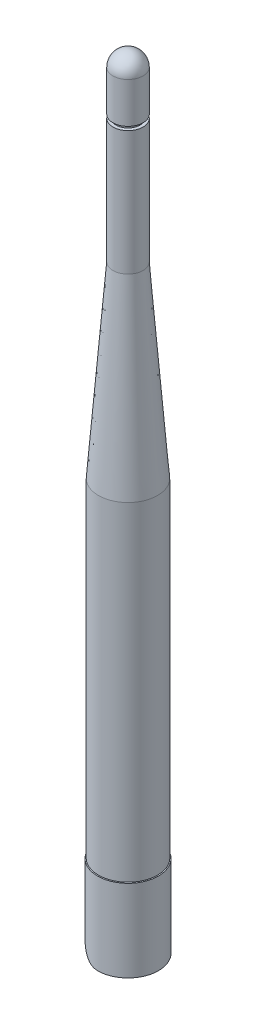
ISO-10303-21;
HEADER;
FILE_DESCRIPTION(('STEP AP214'),'2;1');
FILE_NAME('part.step','',(''),(''),'','','');
FILE_SCHEMA(('AUTOMOTIVE_DESIGN { 1 0 10303 214 1 1 1 1 }'));
ENDSEC;
DATA;
#1=APPLICATION_CONTEXT('core data for automotive mechanical design processes');
#2=APPLICATION_PROTOCOL_DEFINITION('international standard','automotive_design',2000,#1);
#3=PRODUCT_CONTEXT('',#1,'mechanical');
#4=PRODUCT('Part','Part','',(#3));
#5=PRODUCT_RELATED_PRODUCT_CATEGORY('part','',(#4));
#6=PRODUCT_DEFINITION_FORMATION('','',#4);
#7=PRODUCT_DEFINITION_CONTEXT('part definition',#1,'design');
#8=PRODUCT_DEFINITION('design','',#6,#7);
#9=PRODUCT_DEFINITION_SHAPE('','',#8);
#10=(LENGTH_UNIT() NAMED_UNIT(*) SI_UNIT(.MILLI.,.METRE.));
#11=(NAMED_UNIT(*) PLANE_ANGLE_UNIT() SI_UNIT($,.RADIAN.));
#12=(NAMED_UNIT(*) SI_UNIT($,.STERADIAN.) SOLID_ANGLE_UNIT());
#13=UNCERTAINTY_MEASURE_WITH_UNIT(LENGTH_MEASURE(1.E-05),#10,'distance_accuracy_value','');
#14=(GEOMETRIC_REPRESENTATION_CONTEXT(3) GLOBAL_UNCERTAINTY_ASSIGNED_CONTEXT((#13)) GLOBAL_UNIT_ASSIGNED_CONTEXT((#10,
#11,#12)) REPRESENTATION_CONTEXT('',''));
#15=CARTESIAN_POINT('',(0.,0.,0.));
#16=DIRECTION('',(0.,0.,1.));
#17=DIRECTION('',(1.,0.,0.));
#18=AXIS2_PLACEMENT_3D('',#15,#16,#17);
#19=CARTESIAN_POINT('',(6.73734999999998,169.81455,0.));
#20=DIRECTION('',(0.,-1.,0.));
#21=DIRECTION('',(1.,0.,0.));
#22=AXIS2_PLACEMENT_3D('',#19,#20,#21);
#23=SPHERICAL_SURFACE('',#22,3.33375000000006);
#24=CARTESIAN_POINT('',(6.73734999999998,169.81455,0.));
#25=DIRECTION('',(0.,-1.,0.));
#26=DIRECTION('',(1.,0.,0.));
#27=AXIS2_PLACEMENT_3D('',#24,#25,#26);
#28=CIRCLE('',#27,3.33375000000002);
#29=CARTESIAN_POINT('',(10.0711,169.81455,0.));
#30=VERTEX_POINT('',#29);
#31=EDGE_CURVE('E11',#30,#30,#28,.T.);
#32=ORIENTED_EDGE('',*,*,#31,.F.);
#33=EDGE_LOOP('',(#32));
#34=FACE_BOUND('',#33,.T.);
#35=ADVANCED_FACE('F49',(#34),#23,.T.);
#36=CARTESIAN_POINT('',(6.73735,18.1483,0.));
#37=DIRECTION('',(0.,-1.,0.));
#38=DIRECTION('',(1.,0.,0.));
#39=AXIS2_PLACEMENT_3D('',#36,#37,#38);
#40=CYLINDRICAL_SURFACE('',#39,3.33375000000002);
#41=ORIENTED_EDGE('',*,*,#31,.T.);
#42=EDGE_LOOP('',(#41));
#43=FACE_BOUND('',#42,.T.);
#44=CARTESIAN_POINT('',(6.73734999999998,160.8293,0.));
#45=DIRECTION('',(0.,-1.,0.));
#46=DIRECTION('',(1.,0.,0.));
#47=AXIS2_PLACEMENT_3D('',#44,#45,#46);
#48=CIRCLE('',#47,3.33375000000002);
#49=CARTESIAN_POINT('',(10.0711,160.8293,0.));
#50=VERTEX_POINT('',#49);
#51=EDGE_CURVE('E56',#50,#50,#48,.T.);
#52=ORIENTED_EDGE('',*,*,#51,.F.);
#53=EDGE_LOOP('',(#52));
#54=FACE_BOUND('',#53,.T.);
#55=ADVANCED_FACE('F113',(#43,#54),#40,.T.);
#56=CARTESIAN_POINT('',(10.0711,160.8293,0.));
#57=DIRECTION('',(0.,-1.,0.));
#58=DIRECTION('',(1.,0.,0.));
#59=AXIS2_PLACEMENT_3D('',#56,#57,#58);
#60=PLANE('',#59);
#61=ORIENTED_EDGE('',*,*,#51,.T.);
#62=EDGE_LOOP('',(#61));
#63=FACE_BOUND('',#62,.T.);
#64=CARTESIAN_POINT('',(6.73734999999998,160.8293,0.));
#65=DIRECTION('',(0.,-1.,0.));
#66=DIRECTION('',(1.,0.,0.));
#67=AXIS2_PLACEMENT_3D('',#64,#65,#66);
#68=CIRCLE('',#67,2.62890000000002);
#69=CARTESIAN_POINT('',(9.36625,160.8293,0.));
#70=VERTEX_POINT('',#69);
#71=EDGE_CURVE('E61',#70,#70,#68,.T.);
#72=ORIENTED_EDGE('',*,*,#71,.F.);
#73=EDGE_LOOP('',(#72));
#74=FACE_BOUND('',#73,.T.);
#75=ADVANCED_FACE('F118',(#63,#74),#60,.T.);
#76=CARTESIAN_POINT('',(6.73735,18.1483,0.));
#77=DIRECTION('',(0.,-1.,0.));
#78=DIRECTION('',(1.,0.,0.));
#79=AXIS2_PLACEMENT_3D('',#76,#77,#78);
#80=CYLINDRICAL_SURFACE('',#79,2.62890000000002);
#81=ORIENTED_EDGE('',*,*,#71,.T.);
#82=EDGE_LOOP('',(#81));
#83=FACE_BOUND('',#82,.T.);
#84=CARTESIAN_POINT('',(6.73734999999998,160.0165,0.));
#85=DIRECTION('',(0.,-1.,0.));
#86=DIRECTION('',(1.,0.,0.));
#87=AXIS2_PLACEMENT_3D('',#84,#85,#86);
#88=CIRCLE('',#87,2.62890000000002);
#89=CARTESIAN_POINT('',(9.36625,160.0165,0.));
#90=VERTEX_POINT('',#89);
#91=EDGE_CURVE('E66',#90,#90,#88,.T.);
#92=ORIENTED_EDGE('',*,*,#91,.F.);
#93=EDGE_LOOP('',(#92));
#94=FACE_BOUND('',#93,.T.);
#95=ADVANCED_FACE('F122',(#83,#94),#80,.T.);
#96=CARTESIAN_POINT('',(9.36625,160.0165,0.));
#97=DIRECTION('',(0.,1.,0.));
#98=DIRECTION('',(-1.,0.,0.));
#99=AXIS2_PLACEMENT_3D('',#96,#97,#98);
#100=PLANE('',#99);
#101=ORIENTED_EDGE('',*,*,#91,.T.);
#102=EDGE_LOOP('',(#101));
#103=FACE_BOUND('',#102,.T.);
#104=CARTESIAN_POINT('',(6.73734999999998,160.0165,0.));
#105=DIRECTION('',(0.,-1.,0.));
#106=DIRECTION('',(1.,0.,0.));
#107=AXIS2_PLACEMENT_3D('',#104,#105,#106);
#108=CIRCLE('',#107,3.33375000000002);
#109=CARTESIAN_POINT('',(10.0711,160.0165,0.));
#110=VERTEX_POINT('',#109);
#111=EDGE_CURVE('E72',#110,#110,#108,.T.);
#112=ORIENTED_EDGE('',*,*,#111,.F.);
#113=EDGE_LOOP('',(#112));
#114=FACE_BOUND('',#113,.T.);
#115=ADVANCED_FACE('F128',(#103,#114),#100,.T.);
#116=CARTESIAN_POINT('',(6.73735,18.1483,0.));
#117=DIRECTION('',(0.,-1.,0.));
#118=DIRECTION('',(1.,0.,0.));
#119=AXIS2_PLACEMENT_3D('',#116,#117,#118);
#120=CYLINDRICAL_SURFACE('',#119,3.33375000000002);
#121=ORIENTED_EDGE('',*,*,#111,.T.);
#122=EDGE_LOOP('',(#121));
#123=FACE_BOUND('',#122,.T.);
#124=CARTESIAN_POINT('',(6.73734999999999,132.5083,0.));
#125=DIRECTION('',(0.,-1.,0.));
#126=DIRECTION('',(1.,0.,0.));
#127=AXIS2_PLACEMENT_3D('',#124,#125,#126);
#128=CIRCLE('',#127,3.33375000000002);
#129=CARTESIAN_POINT('',(10.0711,132.5083,0.));
#130=VERTEX_POINT('',#129);
#131=EDGE_CURVE('E76',#130,#130,#128,.T.);
#132=ORIENTED_EDGE('',*,*,#131,.F.);
#133=EDGE_LOOP('',(#132));
#134=FACE_BOUND('',#133,.T.);
#135=ADVANCED_FACE('F132',(#123,#134),#120,.T.);
#136=CARTESIAN_POINT('',(6.73734999999999,90.9955,0.));
#137=DIRECTION('',(0.,-1.,0.));
#138=DIRECTION('',(1.,0.,0.));
#139=AXIS2_PLACEMENT_3D('',#136,#137,#138);
#140=CONICAL_SURFACE('',#139,6.54050000000001,0.0770941580717803);
#141=ORIENTED_EDGE('',*,*,#131,.T.);
#142=EDGE_LOOP('',(#141));
#143=FACE_BOUND('',#142,.T.);
#144=CARTESIAN_POINT('',(6.73734999999999,90.9955,0.));
#145=DIRECTION('',(0.,-1.,0.));
#146=DIRECTION('',(1.,0.,0.));
#147=AXIS2_PLACEMENT_3D('',#144,#145,#146);
#148=CIRCLE('',#147,6.54050000000001);
#149=CARTESIAN_POINT('',(13.27785,90.9955,0.));
#150=VERTEX_POINT('',#149);
#151=EDGE_CURVE('E80',#150,#150,#148,.T.);
#152=ORIENTED_EDGE('',*,*,#151,.F.);
#153=EDGE_LOOP('',(#152));
#154=FACE_BOUND('',#153,.T.);
#155=ADVANCED_FACE('F136',(#143,#154),#140,.T.);
#156=CARTESIAN_POINT('',(6.73735,18.1483,0.));
#157=DIRECTION('',(0.,-1.,0.));
#158=DIRECTION('',(1.,0.,0.));
#159=AXIS2_PLACEMENT_3D('',#156,#157,#158);
#160=CYLINDRICAL_SURFACE('',#159,6.54050000000001);
#161=ORIENTED_EDGE('',*,*,#151,.T.);
#162=EDGE_LOOP('',(#161));
#163=FACE_BOUND('',#162,.T.);
#164=CARTESIAN_POINT('',(6.73735,18.2245,0.));
#165=DIRECTION('',(0.,-1.,0.));
#166=DIRECTION('',(1.,0.,0.));
#167=AXIS2_PLACEMENT_3D('',#164,#165,#166);
#168=CIRCLE('',#167,6.5405);
#169=CARTESIAN_POINT('',(13.27785,18.2245,0.));
#170=VERTEX_POINT('',#169);
#171=EDGE_CURVE('E84',#170,#170,#168,.T.);
#172=ORIENTED_EDGE('',*,*,#171,.F.);
#173=EDGE_LOOP('',(#172));
#174=FACE_BOUND('',#173,.T.);
#175=ADVANCED_FACE('F109',(#163,#174),#160,.T.);
#176=CARTESIAN_POINT('',(13.27785,18.2245,0.));
#177=DIRECTION('',(0.,-1.,0.));
#178=DIRECTION('',(1.,0.,0.));
#179=AXIS2_PLACEMENT_3D('',#176,#177,#178);
#180=PLANE('',#179);
#181=ORIENTED_EDGE('',*,*,#171,.T.);
#182=EDGE_LOOP('',(#181));
#183=FACE_BOUND('',#182,.T.);
#184=CARTESIAN_POINT('',(6.73735,18.2245,0.));
#185=DIRECTION('',(0.,-1.,0.));
#186=DIRECTION('',(1.,0.,0.));
#187=AXIS2_PLACEMENT_3D('',#184,#185,#186);
#188=CIRCLE('',#187,1.42875);
#189=CARTESIAN_POINT('',(8.1661,18.2245,0.));
#190=VERTEX_POINT('',#189);
#191=EDGE_CURVE('E88',#190,#190,#188,.T.);
#192=ORIENTED_EDGE('',*,*,#191,.F.);
#193=EDGE_LOOP('',(#192));
#194=FACE_BOUND('',#193,.T.);
#195=ADVANCED_FACE('F101',(#183,#194),#180,.T.);
#196=CARTESIAN_POINT('',(6.73735,18.1483,0.));
#197=DIRECTION('',(0.,-1.,0.));
#198=DIRECTION('',(1.,0.,0.));
#199=AXIS2_PLACEMENT_3D('',#196,#197,#198);
#200=CYLINDRICAL_SURFACE('',#199,1.42875000000001);
#201=ORIENTED_EDGE('',*,*,#191,.T.);
#202=EDGE_LOOP('',(#201));
#203=FACE_BOUND('',#202,.T.);
#204=CARTESIAN_POINT('',(6.73734999999998,169.81455,0.));
#205=DIRECTION('',(0.,-1.,0.));
#206=DIRECTION('',(1.,0.,0.));
#207=AXIS2_PLACEMENT_3D('',#204,#205,#206);
#208=CIRCLE('',#207,1.42875000000002);
#209=CARTESIAN_POINT('',(8.1661,169.81455,0.));
#210=VERTEX_POINT('',#209);
#211=EDGE_CURVE('E92',#210,#210,#208,.T.);
#212=ORIENTED_EDGE('',*,*,#211,.F.);
#213=EDGE_LOOP('',(#212));
#214=FACE_BOUND('',#213,.T.);
#215=ADVANCED_FACE('F99',(#203,#214),#200,.F.);
#216=CARTESIAN_POINT('',(6.73734999999998,169.81455,0.));
#217=DIRECTION('',(0.,-1.,0.));
#218=DIRECTION('',(1.,0.,0.));
#219=AXIS2_PLACEMENT_3D('',#216,#217,#218);
#220=PLANE('',#219);
#221=ORIENTED_EDGE('',*,*,#211,.T.);
#222=EDGE_LOOP('',(#221));
#223=FACE_BOUND('',#222,.T.);
#224=ADVANCED_FACE('F97',(#223),#220,.T.);
#225=CLOSED_SHELL('',(#35,#55,#75,#95,#115,#135,#155,#175,#195,#215,#224));
#226=MANIFOLD_SOLID_BREP('B2',#225);
#227=CARTESIAN_POINT('',(10.9347,13.7033,-4.43865));
#228=DIRECTION('',(0.,0.,1.));
#229=DIRECTION('',(0.,-1.,0.));
#230=AXIS2_PLACEMENT_3D('',#227,#228,#229);
#231=PLANE('',#230);
#232=CARTESIAN_POINT('',(6.73735,7.747,-4.43865));
#233=DIRECTION('',(0.,0.,1.));
#234=DIRECTION('',(0.,-1.,0.));
#235=AXIS2_PLACEMENT_3D('',#232,#233,#234);
#236=CIRCLE('',#235,1.);
#237=CARTESIAN_POINT('',(7.73735,7.747,-4.43865));
#238=VERTEX_POINT('',#237);
#239=EDGE_CURVE('E325',#238,#238,#236,.T.);
#240=ORIENTED_EDGE('',*,*,#239,.F.);
#241=EDGE_LOOP('',(#240));
#242=FACE_BOUND('',#241,.T.);
#243=DIRECTION('',(0.,-1.,0.));
#244=VECTOR('',#243,1.);
#245=CARTESIAN_POINT('',(1.6688054,13.7033,-4.43865));
#246=LINE('',#245,#244);
#247=CARTESIAN_POINT('',(1.6688054,5.0685446,-4.43865714392927));
#248=VERTEX_POINT('',#247);
#249=CARTESIAN_POINT('',(1.6688054,0.,-4.43865714392927));
#250=VERTEX_POINT('',#249);
#251=EDGE_CURVE('E365',#248,#250,#246,.T.);
#252=ORIENTED_EDGE('',*,*,#251,.F.);
#253=CARTESIAN_POINT('',(6.73735,5.0685446,-4.43865));
#254=DIRECTION('',(0.,0.,1.));
#255=DIRECTION('',(0.,-1.,0.));
#256=AXIS2_PLACEMENT_3D('',#253,#254,#255);
#257=CIRCLE('',#256,5.0685446);
#258=CARTESIAN_POINT('',(6.73735,0.,-4.43865));
#259=VERTEX_POINT('',#258);
#260=EDGE_CURVE('E335',#259,#248,#257,.F.);
#261=ORIENTED_EDGE('',*,*,#260,.F.);
#262=DIRECTION('',(-1.,0.,0.));
#263=VECTOR('',#262,1.);
#264=CARTESIAN_POINT('',(10.9347,0.,-4.43865));
#265=LINE('',#264,#263);
#266=CARTESIAN_POINT('',(10.9347,0.,-4.43865));
#267=VERTEX_POINT('',#266);
#268=EDGE_CURVE('E638',#267,#259,#265,.T.);
#269=ORIENTED_EDGE('',*,*,#268,.F.);
#270=DIRECTION('',(0.,1.,0.));
#271=VECTOR('',#270,1.);
#272=CARTESIAN_POINT('',(10.9347,13.7033,-4.43865));
#273=LINE('',#272,#271);
#274=CARTESIAN_POINT('',(10.9347,13.7033,-4.43865));
#275=VERTEX_POINT('',#274);
#276=EDGE_CURVE('E627',#267,#275,#273,.T.);
#277=ORIENTED_EDGE('',*,*,#276,.T.);
#278=DIRECTION('',(-1.,0.,0.));
#279=VECTOR('',#278,1.);
#280=CARTESIAN_POINT('',(10.9347,13.7033,-4.43865));
#281=LINE('',#280,#279);
#282=CARTESIAN_POINT('',(1.6891,13.7033,-4.43865));
#283=VERTEX_POINT('',#282);
#284=EDGE_CURVE('E645',#275,#283,#281,.T.);
#285=ORIENTED_EDGE('',*,*,#284,.T.);
#286=DIRECTION('',(1.,0.,0.));
#287=VECTOR('',#286,1.);
#288=CARTESIAN_POINT('',(10.9347,13.7033,-4.43865));
#289=LINE('',#288,#287);
#290=CARTESIAN_POINT('',(1.66879288776381,13.7033,-4.43865));
#291=VERTEX_POINT('',#290);
#292=EDGE_CURVE('E600',#291,#283,#289,.T.);
#293=ORIENTED_EDGE('',*,*,#292,.F.);
#294=DIRECTION('',(0.,-1.,0.));
#295=VECTOR('',#294,1.);
#296=CARTESIAN_POINT('',(1.66879288776381,18.1483,-4.43864999999999));
#297=LINE('',#296,#295);
#298=EDGE_CURVE('E340',#291,#250,#297,.T.);
#299=ORIENTED_EDGE('',*,*,#298,.T.);
#300=EDGE_LOOP('',(#252,#261,#269,#277,#285,#293,#299));
#301=FACE_BOUND('',#300,.T.);
#302=ADVANCED_FACE('F220',(#242,#301),#231,.T.);
#303=CARTESIAN_POINT('',(10.9347,13.7033,4.43865));
#304=DIRECTION('',(0.,0.,-1.));
#305=DIRECTION('',(0.,1.,0.));
#306=AXIS2_PLACEMENT_3D('',#303,#304,#305);
#307=PLANE('',#306);
#308=CARTESIAN_POINT('',(6.73735,7.747,4.43865));
#309=DIRECTION('',(0.,0.,-1.));
#310=DIRECTION('',(0.,1.,0.));
#311=AXIS2_PLACEMENT_3D('',#308,#309,#310);
#312=CIRCLE('',#311,1.);
#313=CARTESIAN_POINT('',(7.73735,7.747,4.43865));
#314=VERTEX_POINT('',#313);
#315=EDGE_CURVE('E583',#314,#314,#312,.T.);
#316=ORIENTED_EDGE('',*,*,#315,.F.);
#317=EDGE_LOOP('',(#316));
#318=FACE_BOUND('',#317,.T.);
#319=DIRECTION('',(0.,1.,0.));
#320=VECTOR('',#319,1.);
#321=CARTESIAN_POINT('',(1.6688054,13.7033,4.43865));
#322=LINE('',#321,#320);
#323=CARTESIAN_POINT('',(1.6688054,0.,4.43865714392928));
#324=VERTEX_POINT('',#323);
#325=CARTESIAN_POINT('',(1.6688054,5.0685446,4.43865357196464));
#326=VERTEX_POINT('',#325);
#327=EDGE_CURVE('E47',#324,#326,#322,.T.);
#328=ORIENTED_EDGE('',*,*,#327,.F.);
#329=DIRECTION('',(0.,-1.,0.));
#330=VECTOR('',#329,1.);
#331=CARTESIAN_POINT('',(1.66879288776382,18.1483,4.43865000000001));
#332=LINE('',#331,#330);
#333=CARTESIAN_POINT('',(1.66879288776381,13.7033,4.43865));
#334=VERTEX_POINT('',#333);
#335=EDGE_CURVE('E346',#324,#334,#332,.F.);
#336=ORIENTED_EDGE('',*,*,#335,.T.);
#337=DIRECTION('',(-1.,0.,0.));
#338=VECTOR('',#337,1.);
#339=CARTESIAN_POINT('',(10.9347,13.7033,4.43865));
#340=LINE('',#339,#338);
#341=CARTESIAN_POINT('',(1.6891,13.7033,4.43865));
#342=VERTEX_POINT('',#341);
#343=EDGE_CURVE('E642',#342,#334,#340,.T.);
#344=ORIENTED_EDGE('',*,*,#343,.F.);
#345=CARTESIAN_POINT('',(10.9347,13.7033,4.43865));
#346=VERTEX_POINT('',#345);
#347=EDGE_CURVE('E643',#346,#342,#340,.T.);
#348=ORIENTED_EDGE('',*,*,#347,.F.);
#349=DIRECTION('',(0.,-1.,0.));
#350=VECTOR('',#349,1.);
#351=CARTESIAN_POINT('',(10.9347,13.7033,4.43865));
#352=LINE('',#351,#350);
#353=CARTESIAN_POINT('',(10.9347,0.,4.43865));
#354=VERTEX_POINT('',#353);
#355=EDGE_CURVE('E634',#346,#354,#352,.T.);
#356=ORIENTED_EDGE('',*,*,#355,.T.);
#357=DIRECTION('',(-1.,0.,0.));
#358=VECTOR('',#357,1.);
#359=CARTESIAN_POINT('',(10.9347,0.,4.43865));
#360=LINE('',#359,#358);
#361=CARTESIAN_POINT('',(6.73735,0.,4.43865));
#362=VERTEX_POINT('',#361);
#363=EDGE_CURVE('E640',#354,#362,#360,.T.);
#364=ORIENTED_EDGE('',*,*,#363,.T.);
#365=CARTESIAN_POINT('',(6.73735,5.0685446,4.43865));
#366=DIRECTION('',(0.,0.,-1.));
#367=DIRECTION('',(0.,1.,0.));
#368=AXIS2_PLACEMENT_3D('',#365,#366,#367);
#369=CIRCLE('',#368,5.0685446);
#370=EDGE_CURVE('E225',#326,#362,#369,.F.);
#371=ORIENTED_EDGE('',*,*,#370,.F.);
#372=EDGE_LOOP('',(#328,#336,#344,#348,#356,#364,#371));
#373=FACE_BOUND('',#372,.T.);
#374=ADVANCED_FACE('F419',(#318,#373),#307,.T.);
#375=CARTESIAN_POINT('',(6.73735,18.1483,0.));
#376=DIRECTION('',(0.,-1.,0.));
#377=DIRECTION('',(0.,0.,-1.));
#378=AXIS2_PLACEMENT_3D('',#375,#376,#377);
#379=CYLINDRICAL_SURFACE('',#378,6.73735);
#380=CARTESIAN_POINT('',(6.73735,18.1483,0.));
#381=DIRECTION('',(0.,1.,0.));
#382=DIRECTION('',(0.,0.,1.));
#383=AXIS2_PLACEMENT_3D('',#380,#381,#382);
#384=CIRCLE('',#383,6.73735);
#385=CARTESIAN_POINT('',(6.73735,18.1483,6.73735));
#386=VERTEX_POINT('',#385);
#387=EDGE_CURVE('E339',#386,#386,#384,.T.);
#388=ORIENTED_EDGE('',*,*,#387,.F.);
#389=EDGE_LOOP('',(#388));
#390=FACE_BOUND('',#389,.T.);
#391=CARTESIAN_POINT('',(6.73735,0.,-6.73735));
#392=CARTESIAN_POINT('',(6.61298070102183,-2.74027280591213E-05,-6.73737915173229));
#393=CARTESIAN_POINT('',(6.48862888861914,0.00457629189221121,-6.73390748983618));
#394=CARTESIAN_POINT('',(6.24104628108202,0.0228385536054353,-6.72018029918774));
#395=CARTESIAN_POINT('',(6.11781481949731,0.0364913243184836,-6.70992911306458));
#396=CARTESIAN_POINT('',(5.87422293447686,0.0725227607427869,-6.68295157146865));
#397=CARTESIAN_POINT('',(5.75384873818729,0.0948418449415909,-6.6662694347461));
#398=CARTESIAN_POINT('',(5.51597335571716,0.147850411934344,-6.62681348492525));
#399=CARTESIAN_POINT('',(5.39847248717693,0.178540815642627,-6.6040390016238));
#400=CARTESIAN_POINT('',(5.1673919650169,0.247768122009384,-6.55294454107468));
#401=CARTESIAN_POINT('',(5.05380303411192,0.286284714727321,-6.52463892494779));
#402=CARTESIAN_POINT('',(4.83080343748483,0.37073033370062,-6.46300014318649));
#403=CARTESIAN_POINT('',(4.72139445174493,0.416662302342767,-6.42966498219701));
#404=CARTESIAN_POINT('',(4.39999575046689,0.564928627370383,-6.32293851572978));
#405=CARTESIAN_POINT('',(4.19493175845372,0.677703658724627,-6.24284854916499));
#406=CARTESIAN_POINT('',(3.78818562289168,0.938612528337584,-6.06204736979072));
#407=CARTESIAN_POINT('',(3.58854813039279,1.0890440878666,-5.96011719049515));
#408=CARTESIAN_POINT('',(3.21560790065262,1.41493167565289,-5.74763166018481));
#409=CARTESIAN_POINT('',(3.04234033704421,1.59042053268652,-5.6370650816673));
#410=CARTESIAN_POINT('',(2.78683035510081,1.88964276246644,-5.45885003145642));
#411=CARTESIAN_POINT('',(2.69577651919733,2.00623240287675,-5.39160577535333));
#412=CARTESIAN_POINT('',(2.52385249531473,2.24745807888073,-5.25833991043484));
#413=CARTESIAN_POINT('',(2.44298545753586,2.37209658559703,-5.19231868519097));
#414=CARTESIAN_POINT('',(2.29192111596081,2.62917833246823,-5.06358453962678));
#415=CARTESIAN_POINT('',(2.22171558371024,2.76161544303976,-5.00086909259747));
#416=CARTESIAN_POINT('',(2.0925366391675,3.03418662660195,-4.88112142652848));
#417=CARTESIAN_POINT('',(2.03355652301672,3.17431604088282,-4.82408582523022));
#418=CARTESIAN_POINT('',(1.91051530036455,3.50877579338907,-4.70141948219251));
#419=CARTESIAN_POINT('',(1.85093722806547,3.70602546672209,-4.63893805013184));
#420=CARTESIAN_POINT('',(1.77950655831166,4.00989432519085,-4.56211529396279));
#421=CARTESIAN_POINT('',(1.75870271345036,4.1123643508291,-4.53934479006696));
#422=CARTESIAN_POINT('',(1.72334779345001,4.31957571386322,-4.50026229262385));
#423=CARTESIAN_POINT('',(1.70879340311377,4.42431581597822,-4.48394687515809));
#424=CARTESIAN_POINT('',(1.68800810012701,4.61878109613748,-4.46052097323632));
#425=CARTESIAN_POINT('',(1.68082888401092,4.7082805983613,-4.45236718087836));
#426=CARTESIAN_POINT('',(1.67121672535421,4.88802612218415,-4.44141761657569));
#427=CARTESIAN_POINT('',(1.66879268368935,4.97827322682424,-4.43863189291215));
#428=CARTESIAN_POINT('',(1.6688054,5.0685446,-4.43866428785855));
#429=B_SPLINE_CURVE_WITH_KNOTS('',3,(#391,#392,#393,#394,#395,#396,#397,#398,#399,#400,#401,
#402,#403,#404,#405,#406,#407,#408,#409,#410,#411,#412,#413,#414,#415,#416,#417,#418,#419,#420,
#421,#422,#423,#424,#425,#426,#427,#428),.UNSPECIFIED.,.F.,.F.,(4,2,2,2,2,2,2,2,2,2,2,2,2,2,2,2,
2,2,4),(0.,0.372946718412721,0.745654776616077,1.11584455962756,1.48607508301035,
1.85535680920389,2.22478542645214,2.96395219117737,3.77108380252677,4.57928274783591,
5.06633130204903,5.55353010498855,6.04035096008036,6.52688016543663,7.1701282312676,
7.49083772191694,7.81137687246956,8.08156842855527,8.35226525638933),.UNSPECIFIED.);
#430=CARTESIAN_POINT('',(6.73735,0.,-6.73735));
#431=VERTEX_POINT('',#430);
#432=EDGE_CURVE('E334',#431,#248,#429,.T.);
#433=ORIENTED_EDGE('',*,*,#432,.T.);
#434=DIRECTION('',(0.,-1.,0.));
#435=VECTOR('',#434,1.);
#436=CARTESIAN_POINT('',(1.6688054,18.1483,-4.43866428785855));
#437=LINE('',#436,#435);
#438=EDGE_CURVE('E364',#248,#250,#437,.T.);
#439=ORIENTED_EDGE('',*,*,#438,.T.);
#440=ORIENTED_EDGE('',*,*,#298,.F.);
#441=CARTESIAN_POINT('',(6.73735,13.7033,0.));
#442=DIRECTION('',(0.,-1.,0.));
#443=DIRECTION('',(0.,0.,-1.));
#444=AXIS2_PLACEMENT_3D('',#441,#442,#443);
#445=CIRCLE('',#444,6.73735);
#446=CARTESIAN_POINT('',(1.6891,13.7033,-4.46173250654945));
#447=VERTEX_POINT('',#446);
#448=EDGE_CURVE('E599',#291,#447,#445,.T.);
#449=ORIENTED_EDGE('',*,*,#448,.T.);
#450=CARTESIAN_POINT('',(6.73735,6.11194661654136,0.));
#451=DIRECTION('',(0.832690270583029,0.553739029937715,0.));
#452=DIRECTION('',(0.553739029937715,-0.832690270583029,0.));
#453=AXIS2_PLACEMENT_3D('',#450,#451,#452);
#454=ELLIPSE('',#453,12.1670130435953,6.73735);
#455=CARTESIAN_POINT('',(1.6891,13.7033,4.46173250654945));
#456=VERTEX_POINT('',#455);
#457=EDGE_CURVE('E598',#447,#456,#454,.T.);
#458=ORIENTED_EDGE('',*,*,#457,.T.);
#459=EDGE_CURVE('E595',#456,#334,#445,.T.);
#460=ORIENTED_EDGE('',*,*,#459,.T.);
#461=ORIENTED_EDGE('',*,*,#335,.F.);
#462=DIRECTION('',(0.,-1.,0.));
#463=VECTOR('',#462,1.);
#464=CARTESIAN_POINT('',(1.6688054,18.1483,4.43866428785855));
#465=LINE('',#464,#463);
#466=EDGE_CURVE('E333',#324,#326,#465,.F.);
#467=ORIENTED_EDGE('',*,*,#466,.T.);
#468=CARTESIAN_POINT('',(1.6688054,5.0685446,4.43866428785855));
#469=CARTESIAN_POINT('',(1.66876591372531,4.94923652747843,4.43856689461078));
#470=CARTESIAN_POINT('',(1.67301588202675,4.82999358358495,4.44347217564243));
#471=CARTESIAN_POINT('',(1.68977255097797,4.59307710361273,4.46252490724722));
#472=CARTESIAN_POINT('',(1.70226181922479,4.47540078802474,4.47665284420949));
#473=CARTESIAN_POINT('',(1.73496489922012,4.24404639567341,4.51315646158241));
#474=CARTESIAN_POINT('',(1.75507691670886,4.13033631586609,4.53542332089241));
#475=CARTESIAN_POINT('',(1.80258256639609,3.90606613099857,4.58706797710571));
#476=CARTESIAN_POINT('',(1.82997974485235,3.7955075891364,4.61644923651984));
#477=CARTESIAN_POINT('',(1.8913308929613,3.57897882085449,4.6808049987737));
#478=CARTESIAN_POINT('',(1.92522909253314,3.47297834001857,4.7157315207666));
#479=CARTESIAN_POINT('',(1.99929255235307,3.26489465106207,4.79014210994194));
#480=CARTESIAN_POINT('',(2.03945717399103,3.1628110450927,4.82962571260639));
#481=CARTESIAN_POINT('',(2.16915259210297,2.86183282755705,4.95355603171483));
#482=CARTESIAN_POINT('',(2.26768920704091,2.66888801273132,5.04326748242985));
#483=CARTESIAN_POINT('',(2.4433327918332,2.37254429942901,5.19238790049725));
#484=CARTESIAN_POINT('',(2.51353398871948,2.26387486327181,5.24977177506049));
#485=CARTESIAN_POINT('',(2.66171886543174,2.0525825391956,5.36562822523409));
#486=CARTESIAN_POINT('',(2.73970324004241,1.94996019238784,5.42410089765901));
#487=CARTESIAN_POINT('',(2.98517917944423,1.6512646570437,5.59941343649709));
#488=CARTESIAN_POINT('',(3.16421079203867,1.46433398562047,5.71616301337765));
#489=CARTESIAN_POINT('',(3.47472272230641,1.18653531001612,5.89622670986915));
#490=CARTESIAN_POINT('',(3.59693445358365,1.08695338711854,5.96238317718004));
#491=CARTESIAN_POINT('',(3.85186164286881,0.898506553136991,6.08983745725613));
#492=CARTESIAN_POINT('',(3.98457958182405,0.809644185958943,6.15113411553987));
#493=CARTESIAN_POINT('',(4.25977061342266,0.643896290224636,6.26703728938782));
#494=CARTESIAN_POINT('',(4.40222968392908,0.566994046925599,6.32165311845009));
#495=CARTESIAN_POINT('',(4.6962321809561,0.426293029605217,6.42260362399879));
#496=CARTESIAN_POINT('',(4.84777031845565,0.362486720599265,6.46894306045498));
#497=CARTESIAN_POINT('',(5.11153622930357,0.26644335808479,6.53920480251716));
#498=CARTESIAN_POINT('',(5.22175556065281,0.230499749106704,6.56566437486715));
#499=CARTESIAN_POINT('',(5.44544509437844,0.166028641479761,6.61331462671033));
#500=CARTESIAN_POINT('',(5.55891447742009,0.137499291657899,6.634506621341));
#501=CARTESIAN_POINT('',(5.78819221615523,0.0882870553679191,6.67116460963914));
#502=CARTESIAN_POINT('',(5.90399507774393,0.0675875927750309,6.68664269813866));
#503=CARTESIAN_POINT('',(6.1373531766773,0.034259695105327,6.71160505583952));
#504=CARTESIAN_POINT('',(6.25490743731722,0.021626922056887,6.7210925465353));
#505=CARTESIAN_POINT('',(6.4335062582159,0.00875006405337851,6.73076921446183));
#506=CARTESIAN_POINT('',(6.49422970548214,0.0054688525026042,6.73323648877756));
#507=CARTESIAN_POINT('',(6.61574948665424,0.00109438963841251,6.73652664286212));
#508=CARTESIAN_POINT('',(6.67654571886605,-6.67441780028722E-07,6.73735087978137));
#509=CARTESIAN_POINT('',(6.73735,0.,6.73735));
#510=B_SPLINE_CURVE_WITH_KNOTS('',3,(#468,#469,#470,#471,#472,#473,#474,#475,#476,#477,#478,
#479,#480,#481,#482,#483,#484,#485,#486,#487,#488,#489,#490,#491,#492,#493,#494,#495,#496,#497,
#498,#499,#500,#501,#502,#503,#504,#505,#506,#507,#508,#509),.UNSPECIFIED.,.F.,.F.,(4,2,2,2,2,2,
2,2,2,2,2,2,2,2,2,2,2,2,2,2,4),(0.,0.35764419546205,0.714534117107634,1.06681708479377,
1.4192718510818,1.76882832892129,2.11834920675351,2.81958265056402,3.24387478821581,
3.6682048352935,4.51675487514812,5.0290642073346,5.54149487976406,6.0532028471933,
6.56461556361461,6.92100289600462,7.27730116085542,7.63284085205219,7.98818918558498,
8.17072151754177,8.35310301504158),.UNSPECIFIED.);
#511=CARTESIAN_POINT('',(6.73735,0.,6.73735));
#512=VERTEX_POINT('',#511);
#513=EDGE_CURVE('E319',#326,#512,#510,.T.);
#514=ORIENTED_EDGE('',*,*,#513,.T.);
#515=CARTESIAN_POINT('',(6.73735,0.,0.));
#516=DIRECTION('',(0.,1.,0.));
#517=DIRECTION('',(0.,0.,1.));
#518=AXIS2_PLACEMENT_3D('',#515,#516,#517);
#519=CIRCLE('',#518,6.73735);
#520=EDGE_CURVE('E331',#512,#431,#519,.T.);
#521=ORIENTED_EDGE('',*,*,#520,.T.);
#522=EDGE_LOOP('',(#433,#439,#440,#449,#458,#460,#461,#467,#514,#521));
#523=FACE_BOUND('',#522,.T.);
#524=ADVANCED_FACE('F222',(#390,#523),#379,.T.);
#525=CARTESIAN_POINT('',(6.73735,0.,0.));
#526=DIRECTION('',(0.,1.,0.));
#527=DIRECTION('',(0.,0.,1.));
#528=AXIS2_PLACEMENT_3D('',#525,#526,#527);
#529=PLANE('',#528);
#530=ORIENTED_EDGE('',*,*,#520,.F.);
#531=DIRECTION('',(0.,0.,1.));
#532=VECTOR('',#531,1.);
#533=CARTESIAN_POINT('',(6.73735,0.,-6.73735));
#534=LINE('',#533,#532);
#535=EDGE_CURVE('E316',#362,#512,#534,.T.);
#536=ORIENTED_EDGE('',*,*,#535,.F.);
#537=ORIENTED_EDGE('',*,*,#363,.F.);
#538=DIRECTION('',(0.,0.,-1.));
#539=VECTOR('',#538,1.);
#540=CARTESIAN_POINT('',(10.9347,0.,-4.43865));
#541=LINE('',#540,#539);
#542=EDGE_CURVE('E636',#354,#267,#541,.T.);
#543=ORIENTED_EDGE('',*,*,#542,.T.);
#544=ORIENTED_EDGE('',*,*,#268,.T.);
#545=EDGE_CURVE('E238',#431,#259,#534,.T.);
#546=ORIENTED_EDGE('',*,*,#545,.F.);
#547=EDGE_LOOP('',(#530,#536,#537,#543,#544,#546));
#548=FACE_BOUND('',#547,.T.);
#549=ADVANCED_FACE('F337',(#548),#529,.F.);
#550=CARTESIAN_POINT('',(6.73735,18.1483,0.));
#551=DIRECTION('',(0.,1.,0.));
#552=DIRECTION('',(0.,0.,1.));
#553=AXIS2_PLACEMENT_3D('',#550,#551,#552);
#554=PLANE('',#553);
#555=DIRECTION('',(0.,0.,1.));
#556=VECTOR('',#555,1.);
#557=CARTESIAN_POINT('',(2.54,18.1483,4.19735));
#558=LINE('',#557,#556);
#559=CARTESIAN_POINT('',(2.54,18.1483,-4.19735));
#560=VERTEX_POINT('',#559);
#561=CARTESIAN_POINT('',(2.54,18.1483,4.19735));
#562=VERTEX_POINT('',#561);
#563=EDGE_CURVE('E603',#560,#562,#558,.T.);
#564=ORIENTED_EDGE('',*,*,#563,.F.);
#565=DIRECTION('',(-1.,0.,0.));
#566=VECTOR('',#565,1.);
#567=CARTESIAN_POINT('',(2.54,18.1483,-4.19735));
#568=LINE('',#567,#566);
#569=CARTESIAN_POINT('',(10.9347,18.1483,-4.19735));
#570=VERTEX_POINT('',#569);
#571=EDGE_CURVE('E611',#570,#560,#568,.T.);
#572=ORIENTED_EDGE('',*,*,#571,.F.);
#573=DIRECTION('',(0.,0.,-1.));
#574=VECTOR('',#573,1.);
#575=CARTESIAN_POINT('',(10.9347,18.1483,4.19735));
#576=LINE('',#575,#574);
#577=CARTESIAN_POINT('',(10.9347,18.1483,4.19735));
#578=VERTEX_POINT('',#577);
#579=EDGE_CURVE('E608',#578,#570,#576,.T.);
#580=ORIENTED_EDGE('',*,*,#579,.F.);
#581=DIRECTION('',(1.,0.,0.));
#582=VECTOR('',#581,1.);
#583=CARTESIAN_POINT('',(2.54,18.1483,4.19735));
#584=LINE('',#583,#582);
#585=EDGE_CURVE('E605',#562,#578,#584,.T.);
#586=ORIENTED_EDGE('',*,*,#585,.F.);
#587=EDGE_LOOP('',(#564,#572,#580,#586));
#588=FACE_BOUND('',#587,.T.);
#589=ORIENTED_EDGE('',*,*,#387,.T.);
#590=EDGE_LOOP('',(#589));
#591=FACE_BOUND('',#590,.T.);
#592=ADVANCED_FACE('F425',(#588,#591),#554,.T.);
#593=CARTESIAN_POINT('',(10.9347,13.7033,-4.43865));
#594=DIRECTION('',(0.,-1.,0.));
#595=DIRECTION('',(0.,0.,-1.));
#596=AXIS2_PLACEMENT_3D('',#593,#594,#595);
#597=PLANE('',#596);
#598=DIRECTION('',(0.,0.,1.));
#599=VECTOR('',#598,1.);
#600=CARTESIAN_POINT('',(1.6891,13.7033,-6.73735));
#601=LINE('',#600,#599);
#602=EDGE_CURVE('E593',#283,#342,#601,.T.);
#603=ORIENTED_EDGE('',*,*,#602,.F.);
#604=ORIENTED_EDGE('',*,*,#284,.F.);
#605=DIRECTION('',(0.,0.,1.));
#606=VECTOR('',#605,1.);
#607=CARTESIAN_POINT('',(10.9347,13.7033,-4.43865));
#608=LINE('',#607,#606);
#609=CARTESIAN_POINT('',(10.9347,13.7033,-4.19735));
#610=VERTEX_POINT('',#609);
#611=EDGE_CURVE('E631',#275,#610,#608,.T.);
#612=ORIENTED_EDGE('',*,*,#611,.T.);
#613=DIRECTION('',(1.,0.,0.));
#614=VECTOR('',#613,1.);
#615=CARTESIAN_POINT('',(10.9347,13.7033,-4.19735));
#616=LINE('',#615,#614);
#617=CARTESIAN_POINT('',(2.54,13.7033,-4.19735));
#618=VERTEX_POINT('',#617);
#619=EDGE_CURVE('E625',#618,#610,#616,.T.);
#620=ORIENTED_EDGE('',*,*,#619,.F.);
#621=DIRECTION('',(0.,0.,-1.));
#622=VECTOR('',#621,1.);
#623=CARTESIAN_POINT('',(2.54,13.7033,-4.43865));
#624=LINE('',#623,#622);
#625=CARTESIAN_POINT('',(2.54,13.7033,4.19735));
#626=VERTEX_POINT('',#625);
#627=EDGE_CURVE('E343',#626,#618,#624,.T.);
#628=ORIENTED_EDGE('',*,*,#627,.F.);
#629=DIRECTION('',(-1.,0.,0.));
#630=VECTOR('',#629,1.);
#631=CARTESIAN_POINT('',(10.9347,13.7033,4.19735));
#632=LINE('',#631,#630);
#633=CARTESIAN_POINT('',(10.9347,13.7033,4.19735));
#634=VERTEX_POINT('',#633);
#635=EDGE_CURVE('E617',#634,#626,#632,.T.);
#636=ORIENTED_EDGE('',*,*,#635,.F.);
#637=EDGE_CURVE('E630',#634,#346,#608,.T.);
#638=ORIENTED_EDGE('',*,*,#637,.T.);
#639=ORIENTED_EDGE('',*,*,#347,.T.);
#640=EDGE_LOOP('',(#603,#604,#612,#620,#628,#636,#638,#639));
#641=FACE_BOUND('',#640,.T.);
#642=ADVANCED_FACE('F417',(#641),#597,.T.);
#643=CARTESIAN_POINT('',(10.9347,0.,0.));
#644=DIRECTION('',(-1.,0.,0.));
#645=DIRECTION('',(0.,0.,1.));
#646=AXIS2_PLACEMENT_3D('',#643,#644,#645);
#647=PLANE('',#646);
#648=ORIENTED_EDGE('',*,*,#637,.F.);
#649=DIRECTION('',(0.,1.,0.));
#650=VECTOR('',#649,1.);
#651=CARTESIAN_POINT('',(10.9347,-1.2E-05,4.19735));
#652=LINE('',#651,#650);
#653=EDGE_CURVE('E620',#634,#578,#652,.T.);
#654=ORIENTED_EDGE('',*,*,#653,.T.);
#655=ORIENTED_EDGE('',*,*,#579,.T.);
#656=DIRECTION('',(0.,1.,0.));
#657=VECTOR('',#656,1.);
#658=CARTESIAN_POINT('',(10.9347,-1.2E-05,-4.19735));
#659=LINE('',#658,#657);
#660=EDGE_CURVE('E618',#610,#570,#659,.T.);
#661=ORIENTED_EDGE('',*,*,#660,.F.);
#662=ORIENTED_EDGE('',*,*,#611,.F.);
#663=ORIENTED_EDGE('',*,*,#276,.F.);
#664=ORIENTED_EDGE('',*,*,#542,.F.);
#665=ORIENTED_EDGE('',*,*,#355,.F.);
#666=EDGE_LOOP('',(#648,#654,#655,#661,#662,#663,#664,#665));
#667=FACE_BOUND('',#666,.T.);
#668=ADVANCED_FACE('F413',(#667),#647,.T.);
#669=CARTESIAN_POINT('',(2.54,-1.2E-05,4.19735));
#670=DIRECTION('',(-1.,0.,0.));
#671=DIRECTION('',(0.,0.,1.));
#672=AXIS2_PLACEMENT_3D('',#669,#670,#671);
#673=PLANE('',#672);
#674=ORIENTED_EDGE('',*,*,#627,.T.);
#675=DIRECTION('',(0.,1.,0.));
#676=VECTOR('',#675,1.);
#677=CARTESIAN_POINT('',(2.54,-1.2E-05,-4.19735));
#678=LINE('',#677,#676);
#679=EDGE_CURVE('E615',#618,#560,#678,.T.);
#680=ORIENTED_EDGE('',*,*,#679,.T.);
#681=ORIENTED_EDGE('',*,*,#563,.T.);
#682=DIRECTION('',(0.,1.,0.));
#683=VECTOR('',#682,1.);
#684=CARTESIAN_POINT('',(2.54,-1.2E-05,4.19735));
#685=LINE('',#684,#683);
#686=EDGE_CURVE('E614',#626,#562,#685,.T.);
#687=ORIENTED_EDGE('',*,*,#686,.F.);
#688=EDGE_LOOP('',(#674,#680,#681,#687));
#689=FACE_BOUND('',#688,.T.);
#690=ADVANCED_FACE('F406',(#689),#673,.F.);
#691=CARTESIAN_POINT('',(2.54,-1.2E-05,-4.19735));
#692=DIRECTION('',(0.,0.,-1.));
#693=DIRECTION('',(-1.,0.,0.));
#694=AXIS2_PLACEMENT_3D('',#691,#692,#693);
#695=PLANE('',#694);
#696=ORIENTED_EDGE('',*,*,#619,.T.);
#697=ORIENTED_EDGE('',*,*,#660,.T.);
#698=ORIENTED_EDGE('',*,*,#571,.T.);
#699=ORIENTED_EDGE('',*,*,#679,.F.);
#700=EDGE_LOOP('',(#696,#697,#698,#699));
#701=FACE_BOUND('',#700,.T.);
#702=ADVANCED_FACE('F403',(#701),#695,.F.);
#703=CARTESIAN_POINT('',(2.54,-1.2E-05,4.19735));
#704=DIRECTION('',(0.,0.,1.));
#705=DIRECTION('',(1.,0.,0.));
#706=AXIS2_PLACEMENT_3D('',#703,#704,#705);
#707=PLANE('',#706);
#708=ORIENTED_EDGE('',*,*,#635,.T.);
#709=ORIENTED_EDGE('',*,*,#686,.T.);
#710=ORIENTED_EDGE('',*,*,#585,.T.);
#711=ORIENTED_EDGE('',*,*,#653,.F.);
#712=EDGE_LOOP('',(#708,#709,#710,#711));
#713=FACE_BOUND('',#712,.T.);
#714=ADVANCED_FACE('F397',(#713),#707,.F.);
#715=CARTESIAN_POINT('',(1.6891,13.7033,-6.73735));
#716=DIRECTION('',(0.832690270583029,0.553739029937715,0.));
#717=DIRECTION('',(-0.553739029937715,0.832690270583029,0.));
#718=AXIS2_PLACEMENT_3D('',#715,#716,#717);
#719=PLANE('',#718);
#720=EDGE_CURVE('E594',#447,#283,#601,.T.);
#721=ORIENTED_EDGE('',*,*,#720,.T.);
#722=ORIENTED_EDGE('',*,*,#602,.T.);
#723=EDGE_CURVE('E370',#342,#456,#601,.T.);
#724=ORIENTED_EDGE('',*,*,#723,.T.);
#725=ORIENTED_EDGE('',*,*,#457,.F.);
#726=EDGE_LOOP('',(#721,#722,#724,#725));
#727=FACE_BOUND('',#726,.T.);
#728=ADVANCED_FACE('F392',(#727),#719,.F.);
#729=CARTESIAN_POINT('',(0.,13.7033,-6.73735));
#730=DIRECTION('',(0.,-1.,0.));
#731=DIRECTION('',(0.,0.,-1.));
#732=AXIS2_PLACEMENT_3D('',#729,#730,#731);
#733=PLANE('',#732);
#734=ORIENTED_EDGE('',*,*,#723,.F.);
#735=ORIENTED_EDGE('',*,*,#343,.T.);
#736=ORIENTED_EDGE('',*,*,#459,.F.);
#737=EDGE_LOOP('',(#734,#735,#736));
#738=FACE_BOUND('',#737,.T.);
#739=ADVANCED_FACE('F396',(#738),#733,.F.);
#740=ORIENTED_EDGE('',*,*,#292,.T.);
#741=ORIENTED_EDGE('',*,*,#720,.F.);
#742=ORIENTED_EDGE('',*,*,#448,.F.);
#743=EDGE_LOOP('',(#740,#741,#742));
#744=FACE_BOUND('',#743,.T.);
#745=ADVANCED_FACE('F401',(#744),#733,.F.);
#746=CARTESIAN_POINT('',(6.73735,5.0685446,-6.73735));
#747=DIRECTION('',(0.,0.,1.));
#748=DIRECTION('',(1.,0.,0.));
#749=AXIS2_PLACEMENT_3D('',#746,#747,#748);
#750=CYLINDRICAL_SURFACE('',#749,5.0685446);
#751=ORIENTED_EDGE('',*,*,#370,.T.);
#752=ORIENTED_EDGE('',*,*,#535,.T.);
#753=ORIENTED_EDGE('',*,*,#513,.F.);
#754=EDGE_LOOP('',(#751,#752,#753));
#755=FACE_BOUND('',#754,.T.);
#756=ADVANCED_FACE('F318',(#755),#750,.T.);
#757=CARTESIAN_POINT('',(1.6688054,5.0685446,-6.73735));
#758=DIRECTION('',(-1.,0.,0.));
#759=DIRECTION('',(0.,-1.,0.));
#760=AXIS2_PLACEMENT_3D('',#757,#758,#759);
#761=PLANE('',#760);
#762=ORIENTED_EDGE('',*,*,#327,.T.);
#763=ORIENTED_EDGE('',*,*,#466,.F.);
#764=EDGE_LOOP('',(#762,#763));
#765=FACE_BOUND('',#764,.T.);
#766=ADVANCED_FACE('F390',(#765),#761,.F.);
#767=ORIENTED_EDGE('',*,*,#545,.T.);
#768=ORIENTED_EDGE('',*,*,#260,.T.);
#769=ORIENTED_EDGE('',*,*,#432,.F.);
#770=EDGE_LOOP('',(#767,#768,#769));
#771=FACE_BOUND('',#770,.T.);
#772=ADVANCED_FACE('F384',(#771),#750,.T.);
#773=ORIENTED_EDGE('',*,*,#251,.T.);
#774=ORIENTED_EDGE('',*,*,#438,.F.);
#775=EDGE_LOOP('',(#773,#774));
#776=FACE_BOUND('',#775,.T.);
#777=ADVANCED_FACE('F389',(#776),#761,.F.);
#778=CARTESIAN_POINT('',(6.73735,7.747,-6.738375));
#779=DIRECTION('',(0.,0.,1.));
#780=DIRECTION('',(1.,0.,0.));
#781=AXIS2_PLACEMENT_3D('',#778,#779,#780);
#782=CYLINDRICAL_SURFACE('',#781,1.);
#783=CARTESIAN_POINT('',(7.73735,7.747,-4.43865));
#784=CARTESIAN_POINT('',(7.73735,7.747,-4.346178125));
#785=CARTESIAN_POINT('',(7.73735,7.747,-4.25370625));
#786=CARTESIAN_POINT('',(7.73735,7.747,-4.0687625));
#787=CARTESIAN_POINT('',(7.73735,7.747,-3.976290625));
#788=CARTESIAN_POINT('',(7.73735,7.747,-3.791346875));
#789=CARTESIAN_POINT('',(7.73735,7.747,-3.698875));
#790=CARTESIAN_POINT('',(7.73735,7.747,-3.51393125));
#791=CARTESIAN_POINT('',(7.73735,7.747,-3.421459375));
#792=CARTESIAN_POINT('',(7.73735,7.747,-3.236515625));
#793=CARTESIAN_POINT('',(7.73735,7.747,-3.14404375));
#794=CARTESIAN_POINT('',(7.73735,7.747,-2.9591));
#795=CARTESIAN_POINT('',(7.73735,7.747,-2.866628125));
#796=CARTESIAN_POINT('',(7.73735,7.747,-2.681684375));
#797=CARTESIAN_POINT('',(7.73735,7.747,-2.5892125));
#798=CARTESIAN_POINT('',(7.73735,7.747,-2.40426875));
#799=CARTESIAN_POINT('',(7.73735,7.747,-2.311796875));
#800=CARTESIAN_POINT('',(7.73735,7.747,-2.126853125));
#801=CARTESIAN_POINT('',(7.73735,7.747,-2.03438125));
#802=CARTESIAN_POINT('',(7.73735,7.747,-1.8494375));
#803=CARTESIAN_POINT('',(7.73735,7.747,-1.756965625));
#804=CARTESIAN_POINT('',(7.73735,7.747,-1.572021875));
#805=CARTESIAN_POINT('',(7.73735,7.747,-1.47955));
#806=CARTESIAN_POINT('',(7.73735,7.747,-1.29460625));
#807=CARTESIAN_POINT('',(7.73735,7.747,-1.202134375));
#808=CARTESIAN_POINT('',(7.73735,7.747,-1.017190625));
#809=CARTESIAN_POINT('',(7.73735,7.747,-0.924718749999998));
#810=CARTESIAN_POINT('',(7.73735,7.747,-0.739774999999998));
#811=CARTESIAN_POINT('',(7.73735,7.747,-0.647303124999998));
#812=CARTESIAN_POINT('',(7.73735,7.747,-0.462359374999998));
#813=CARTESIAN_POINT('',(7.73735,7.747,-0.369887499999998));
#814=CARTESIAN_POINT('',(7.73735,7.747,-0.184943749999998));
#815=CARTESIAN_POINT('',(7.73735,7.747,-0.0924718749999983));
#816=CARTESIAN_POINT('',(7.73735,7.747,0.0924718750000018));
#817=CARTESIAN_POINT('',(7.73735,7.747,0.184943750000002));
#818=CARTESIAN_POINT('',(7.73735,7.747,0.369887500000002));
#819=CARTESIAN_POINT('',(7.73735,7.747,0.462359375000002));
#820=CARTESIAN_POINT('',(7.73735,7.747,0.647303125000002));
#821=CARTESIAN_POINT('',(7.73735,7.747,0.739775000000002));
#822=CARTESIAN_POINT('',(7.73735,7.747,0.924718750000001));
#823=CARTESIAN_POINT('',(7.73735,7.747,1.017190625));
#824=CARTESIAN_POINT('',(7.73735,7.747,1.202134375));
#825=CARTESIAN_POINT('',(7.73735,7.747,1.29460625));
#826=CARTESIAN_POINT('',(7.73735,7.747,1.47955));
#827=CARTESIAN_POINT('',(7.73735,7.747,1.572021875));
#828=CARTESIAN_POINT('',(7.73735,7.747,1.756965625));
#829=CARTESIAN_POINT('',(7.73735,7.747,1.8494375));
#830=CARTESIAN_POINT('',(7.73735,7.747,2.03438125));
#831=CARTESIAN_POINT('',(7.73735,7.747,2.126853125));
#832=CARTESIAN_POINT('',(7.73735,7.747,2.311796875));
#833=CARTESIAN_POINT('',(7.73735,7.747,2.40426875));
#834=CARTESIAN_POINT('',(7.73735,7.747,2.5892125));
#835=CARTESIAN_POINT('',(7.73735,7.747,2.681684375));
#836=CARTESIAN_POINT('',(7.73735,7.747,2.866628125));
#837=CARTESIAN_POINT('',(7.73735,7.747,2.9591));
#838=CARTESIAN_POINT('',(7.73735,7.747,3.14404375));
#839=CARTESIAN_POINT('',(7.73735,7.747,3.236515625));
#840=CARTESIAN_POINT('',(7.73735,7.747,3.421459375));
#841=CARTESIAN_POINT('',(7.73735,7.747,3.51393125));
#842=CARTESIAN_POINT('',(7.73735,7.747,3.698875));
#843=CARTESIAN_POINT('',(7.73735,7.747,3.791346875));
#844=CARTESIAN_POINT('',(7.73735,7.747,3.976290625));
#845=CARTESIAN_POINT('',(7.73735,7.747,4.0687625));
#846=CARTESIAN_POINT('',(7.73735,7.747,4.25370625));
#847=CARTESIAN_POINT('',(7.73735,7.747,4.346178125));
#848=CARTESIAN_POINT('',(7.73735,7.747,4.43865));
#849=B_SPLINE_CURVE_WITH_KNOTS('',3,(#783,#784,#785,#786,#787,#788,#789,#790,#791,#792,#793,
#794,#795,#796,#797,#798,#799,#800,#801,#802,#803,#804,#805,#806,#807,#808,#809,#810,#811,#812,
#813,#814,#815,#816,#817,#818,#819,#820,#821,#822,#823,#824,#825,#826,#827,#828,#829,#830,#831,
#832,#833,#834,#835,#836,#837,#838,#839,#840,#841,#842,#843,#844,#845,#846,#847,#848),
.UNSPECIFIED.,.F.,.F.,(4,2,2,2,2,2,2,2,2,2,2,2,2,2,2,2,2,2,2,2,2,2,2,2,2,2,2,2,2,2,2,2,4),(0.,
0.277415625000001,0.55483125,0.832246875,1.1096625,1.387078125,1.66449375,1.941909375,2.219325,
2.496740625,2.77415625,3.051571875,3.3289875,3.606403125,3.88381875,4.161234375,4.43865,
4.716065625,4.99348125,5.270896875,5.5483125,5.825728125,6.10314375,6.380559375,6.657975,
6.935390625,7.21280625,7.490221875,7.7676375,8.045053125,8.32246875,8.599884375,8.8773),.UNSPECIFIED.);
#850=EDGE_CURVE('BSEAM480',#238,#314,#849,.T.);
#851=ORIENTED_EDGE('',*,*,#239,.T.);
#852=ORIENTED_EDGE('',*,*,#315,.T.);
#853=ORIENTED_EDGE('',*,*,#850,.T.);
#854=ORIENTED_EDGE('',*,*,#850,.F.);
#855=EDGE_LOOP('',(#851,#853,#852,#854));
#856=FACE_BOUND('',#855,.T.);
#857=ADVANCED_FACE('F480',(#856),#782,.T.);
#858=CLOSED_SHELL('',(#302,#374,#524,#549,#592,#642,#668,#690,#702,#714,#728,#739,#745,#756,
#766,#772,#777,#857));
#859=MANIFOLD_SOLID_BREP('B6',#858);
#860=ADVANCED_BREP_SHAPE_REPRESENTATION('',(#18,#226,#859),#14);
#861=SHAPE_DEFINITION_REPRESENTATION(#9,#860);
ENDSEC;
END-ISO-10303-21;
